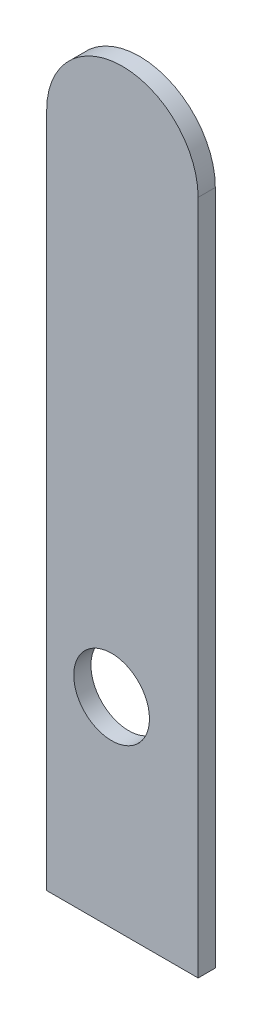
ISO-10303-21;
HEADER;
FILE_DESCRIPTION(('STEP AP214'),'2;1');
FILE_NAME('part.step','',(''),(''),'','','');
FILE_SCHEMA(('AUTOMOTIVE_DESIGN { 1 0 10303 214 1 1 1 1 }'));
ENDSEC;
DATA;
#1=APPLICATION_CONTEXT('core data for automotive mechanical design processes');
#2=APPLICATION_PROTOCOL_DEFINITION('international standard','automotive_design',2000,#1);
#3=PRODUCT_CONTEXT('',#1,'mechanical');
#4=PRODUCT('Part','Part','',(#3));
#5=PRODUCT_RELATED_PRODUCT_CATEGORY('part','',(#4));
#6=PRODUCT_DEFINITION_FORMATION('','',#4);
#7=PRODUCT_DEFINITION_CONTEXT('part definition',#1,'design');
#8=PRODUCT_DEFINITION('design','',#6,#7);
#9=PRODUCT_DEFINITION_SHAPE('','',#8);
#10=(LENGTH_UNIT() NAMED_UNIT(*) SI_UNIT(.MILLI.,.METRE.));
#11=(NAMED_UNIT(*) PLANE_ANGLE_UNIT() SI_UNIT($,.RADIAN.));
#12=(NAMED_UNIT(*) SI_UNIT($,.STERADIAN.) SOLID_ANGLE_UNIT());
#13=UNCERTAINTY_MEASURE_WITH_UNIT(LENGTH_MEASURE(1.E-05),#10,'distance_accuracy_value','');
#14=(GEOMETRIC_REPRESENTATION_CONTEXT(3) GLOBAL_UNCERTAINTY_ASSIGNED_CONTEXT((#13)) GLOBAL_UNIT_ASSIGNED_CONTEXT((#10,
#11,#12)) REPRESENTATION_CONTEXT('',''));
#15=CARTESIAN_POINT('',(0.,0.,0.));
#16=DIRECTION('',(0.,0.,1.));
#17=DIRECTION('',(1.,0.,0.));
#18=AXIS2_PLACEMENT_3D('',#15,#16,#17);
#19=CARTESIAN_POINT('',(7.,62.5,1.5875));
#20=DIRECTION('',(0.,0.,1.));
#21=DIRECTION('',(1.,0.,0.));
#22=AXIS2_PLACEMENT_3D('',#19,#20,#21);
#23=PLANE('',#22);
#24=CARTESIAN_POINT('',(7.,62.5,1.5875));
#25=DIRECTION('',(0.,0.,1.));
#26=DIRECTION('',(1.,0.,0.));
#27=AXIS2_PLACEMENT_3D('',#24,#25,#26);
#28=CIRCLE('',#27,7.);
#29=CARTESIAN_POINT('',(14.,62.5,1.5875));
#30=VERTEX_POINT('',#29);
#31=CARTESIAN_POINT('',(0.,62.5,1.5875));
#32=VERTEX_POINT('',#31);
#33=EDGE_CURVE('E84',#30,#32,#28,.T.);
#34=ORIENTED_EDGE('',*,*,#33,.T.);
#35=DIRECTION('',(0.,-1.,0.));
#36=VECTOR('',#35,1.);
#37=CARTESIAN_POINT('',(0.,0.,1.5875));
#38=LINE('',#37,#36);
#39=CARTESIAN_POINT('',(0.,0.,1.5875));
#40=VERTEX_POINT('',#39);
#41=EDGE_CURVE('E79',#32,#40,#38,.T.);
#42=ORIENTED_EDGE('',*,*,#41,.T.);
#43=DIRECTION('',(1.,0.,0.));
#44=VECTOR('',#43,1.);
#45=CARTESIAN_POINT('',(14.,0.,1.5875));
#46=LINE('',#45,#44);
#47=CARTESIAN_POINT('',(14.,0.,1.5875));
#48=VERTEX_POINT('',#47);
#49=EDGE_CURVE('E82',#40,#48,#46,.T.);
#50=ORIENTED_EDGE('',*,*,#49,.T.);
#51=DIRECTION('',(0.,1.,0.));
#52=VECTOR('',#51,1.);
#53=CARTESIAN_POINT('',(14.,62.5,1.5875));
#54=LINE('',#53,#52);
#55=EDGE_CURVE('E49',#48,#30,#54,.T.);
#56=ORIENTED_EDGE('',*,*,#55,.T.);
#57=EDGE_LOOP('',(#34,#42,#50,#56));
#58=FACE_BOUND('',#57,.T.);
#59=CARTESIAN_POINT('',(6.,18.5,1.5875));
#60=DIRECTION('',(0.,0.,1.));
#61=DIRECTION('',(1.,0.,0.));
#62=AXIS2_PLACEMENT_3D('',#59,#60,#61);
#63=CIRCLE('',#62,3.5);
#64=CARTESIAN_POINT('',(9.5,18.5,1.5875));
#65=VERTEX_POINT('',#64);
#66=EDGE_CURVE('E99',#65,#65,#63,.T.);
#67=ORIENTED_EDGE('',*,*,#66,.F.);
#68=EDGE_LOOP('',(#67));
#69=FACE_BOUND('',#68,.T.);
#70=ADVANCED_FACE('F32',(#58,#69),#23,.T.);
#71=CARTESIAN_POINT('',(7.,62.5,0.));
#72=DIRECTION('',(0.,0.,1.));
#73=DIRECTION('',(1.,0.,0.));
#74=AXIS2_PLACEMENT_3D('',#71,#72,#73);
#75=PLANE('',#74);
#76=CARTESIAN_POINT('',(7.,62.5,0.));
#77=DIRECTION('',(0.,0.,1.));
#78=DIRECTION('',(1.,0.,0.));
#79=AXIS2_PLACEMENT_3D('',#76,#77,#78);
#80=CIRCLE('',#79,7.);
#81=CARTESIAN_POINT('',(14.,62.5,0.));
#82=VERTEX_POINT('',#81);
#83=CARTESIAN_POINT('',(0.,62.5,0.));
#84=VERTEX_POINT('',#83);
#85=EDGE_CURVE('E96',#82,#84,#80,.T.);
#86=ORIENTED_EDGE('',*,*,#85,.F.);
#87=DIRECTION('',(0.,1.,0.));
#88=VECTOR('',#87,1.);
#89=CARTESIAN_POINT('',(14.,62.5,0.));
#90=LINE('',#89,#88);
#91=CARTESIAN_POINT('',(14.,0.,0.));
#92=VERTEX_POINT('',#91);
#93=EDGE_CURVE('E72',#92,#82,#90,.T.);
#94=ORIENTED_EDGE('',*,*,#93,.F.);
#95=DIRECTION('',(1.,0.,0.));
#96=VECTOR('',#95,1.);
#97=CARTESIAN_POINT('',(14.,0.,0.));
#98=LINE('',#97,#96);
#99=CARTESIAN_POINT('',(0.,0.,0.));
#100=VERTEX_POINT('',#99);
#101=EDGE_CURVE('E66',#100,#92,#98,.T.);
#102=ORIENTED_EDGE('',*,*,#101,.F.);
#103=DIRECTION('',(0.,-1.,0.));
#104=VECTOR('',#103,1.);
#105=CARTESIAN_POINT('',(0.,0.,0.));
#106=LINE('',#105,#104);
#107=EDGE_CURVE('E88',#84,#100,#106,.T.);
#108=ORIENTED_EDGE('',*,*,#107,.F.);
#109=EDGE_LOOP('',(#86,#94,#102,#108));
#110=FACE_BOUND('',#109,.T.);
#111=CARTESIAN_POINT('',(6.,18.5,0.));
#112=DIRECTION('',(0.,0.,1.));
#113=DIRECTION('',(1.,0.,0.));
#114=AXIS2_PLACEMENT_3D('',#111,#112,#113);
#115=CIRCLE('',#114,3.5);
#116=CARTESIAN_POINT('',(9.5,18.5,0.));
#117=VERTEX_POINT('',#116);
#118=EDGE_CURVE('E111',#117,#117,#115,.T.);
#119=ORIENTED_EDGE('',*,*,#118,.T.);
#120=EDGE_LOOP('',(#119));
#121=FACE_BOUND('',#120,.T.);
#122=ADVANCED_FACE('F107',(#110,#121),#75,.F.);
#123=CARTESIAN_POINT('',(7.,62.5,1.5875));
#124=DIRECTION('',(0.,0.,-1.));
#125=DIRECTION('',(-1.,0.,0.));
#126=AXIS2_PLACEMENT_3D('',#123,#124,#125);
#127=CYLINDRICAL_SURFACE('',#126,7.);
#128=ORIENTED_EDGE('',*,*,#85,.T.);
#129=DIRECTION('',(0.,0.,-1.));
#130=VECTOR('',#129,1.);
#131=CARTESIAN_POINT('',(0.,62.5,1.5875));
#132=LINE('',#131,#130);
#133=EDGE_CURVE('E11',#32,#84,#132,.T.);
#134=ORIENTED_EDGE('',*,*,#133,.F.);
#135=ORIENTED_EDGE('',*,*,#33,.F.);
#136=DIRECTION('',(0.,0.,-1.));
#137=VECTOR('',#136,1.);
#138=CARTESIAN_POINT('',(14.,62.5,1.5875));
#139=LINE('',#138,#137);
#140=EDGE_CURVE('E92',#30,#82,#139,.T.);
#141=ORIENTED_EDGE('',*,*,#140,.T.);
#142=EDGE_LOOP('',(#128,#134,#135,#141));
#143=FACE_BOUND('',#142,.T.);
#144=ADVANCED_FACE('F34',(#143),#127,.T.);
#145=CARTESIAN_POINT('',(0.,0.,1.5875));
#146=DIRECTION('',(1.,0.,0.));
#147=DIRECTION('',(0.,0.,-1.));
#148=AXIS2_PLACEMENT_3D('',#145,#146,#147);
#149=PLANE('',#148);
#150=ORIENTED_EDGE('',*,*,#107,.T.);
#151=DIRECTION('',(0.,0.,-1.));
#152=VECTOR('',#151,1.);
#153=CARTESIAN_POINT('',(0.,0.,1.5875));
#154=LINE('',#153,#152);
#155=EDGE_CURVE('E41',#40,#100,#154,.T.);
#156=ORIENTED_EDGE('',*,*,#155,.F.);
#157=ORIENTED_EDGE('',*,*,#41,.F.);
#158=ORIENTED_EDGE('',*,*,#133,.T.);
#159=EDGE_LOOP('',(#150,#156,#157,#158));
#160=FACE_BOUND('',#159,.T.);
#161=ADVANCED_FACE('F87',(#160),#149,.F.);
#162=CARTESIAN_POINT('',(14.,0.,1.5875));
#163=DIRECTION('',(0.,1.,0.));
#164=DIRECTION('',(0.,0.,1.));
#165=AXIS2_PLACEMENT_3D('',#162,#163,#164);
#166=PLANE('',#165);
#167=ORIENTED_EDGE('',*,*,#101,.T.);
#168=DIRECTION('',(0.,0.,-1.));
#169=VECTOR('',#168,1.);
#170=CARTESIAN_POINT('',(14.,0.,1.5875));
#171=LINE('',#170,#169);
#172=EDGE_CURVE('E89',#48,#92,#171,.T.);
#173=ORIENTED_EDGE('',*,*,#172,.F.);
#174=ORIENTED_EDGE('',*,*,#49,.F.);
#175=ORIENTED_EDGE('',*,*,#155,.T.);
#176=EDGE_LOOP('',(#167,#173,#174,#175));
#177=FACE_BOUND('',#176,.T.);
#178=ADVANCED_FACE('F90',(#177),#166,.F.);
#179=CARTESIAN_POINT('',(14.,62.5,1.5875));
#180=DIRECTION('',(-1.,0.,0.));
#181=DIRECTION('',(0.,0.,1.));
#182=AXIS2_PLACEMENT_3D('',#179,#180,#181);
#183=PLANE('',#182);
#184=ORIENTED_EDGE('',*,*,#93,.T.);
#185=ORIENTED_EDGE('',*,*,#140,.F.);
#186=ORIENTED_EDGE('',*,*,#55,.F.);
#187=ORIENTED_EDGE('',*,*,#172,.T.);
#188=EDGE_LOOP('',(#184,#185,#186,#187));
#189=FACE_BOUND('',#188,.T.);
#190=ADVANCED_FACE('F104',(#189),#183,.F.);
#191=CARTESIAN_POINT('',(6.,18.5,1.5875));
#192=DIRECTION('',(0.,0.,-1.));
#193=DIRECTION('',(-1.,0.,0.));
#194=AXIS2_PLACEMENT_3D('',#191,#192,#193);
#195=CYLINDRICAL_SURFACE('',#194,3.5);
#196=ORIENTED_EDGE('',*,*,#66,.T.);
#197=EDGE_LOOP('',(#196));
#198=FACE_BOUND('',#197,.T.);
#199=ORIENTED_EDGE('',*,*,#118,.F.);
#200=EDGE_LOOP('',(#199));
#201=FACE_BOUND('',#200,.T.);
#202=ADVANCED_FACE('F117',(#198,#201),#195,.F.);
#203=CLOSED_SHELL('',(#70,#122,#144,#161,#178,#190,#202));
#204=MANIFOLD_SOLID_BREP('B2',#203);
#205=ADVANCED_BREP_SHAPE_REPRESENTATION('',(#18,#204),#14);
#206=SHAPE_DEFINITION_REPRESENTATION(#9,#205);
ENDSEC;
END-ISO-10303-21;
